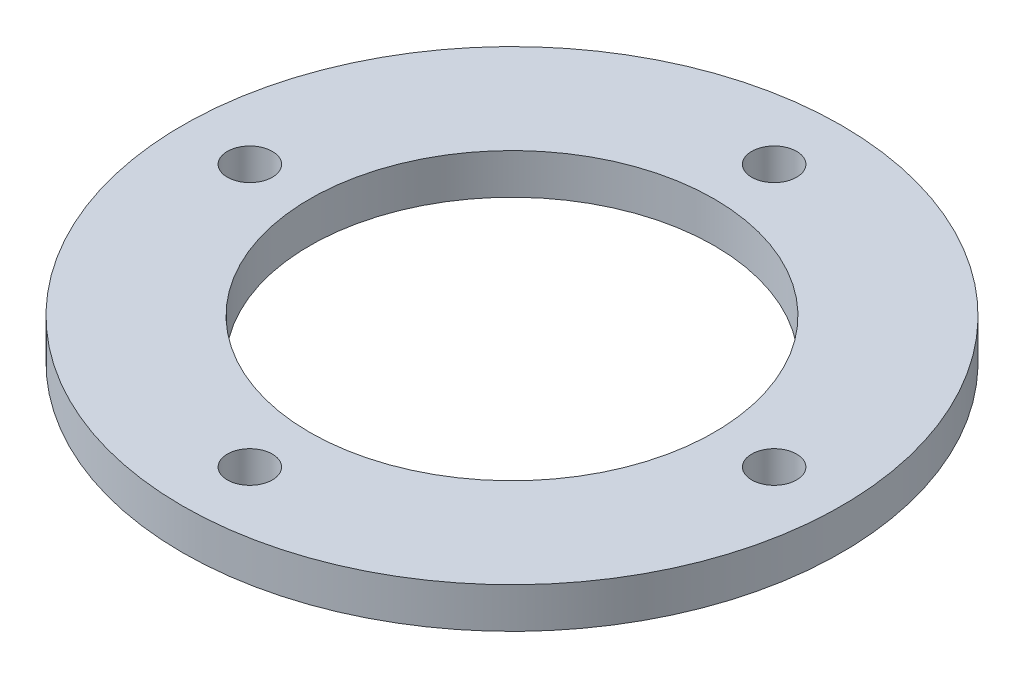
ISO-10303-21;
HEADER;
FILE_DESCRIPTION(('STEP AP214'),'2;1');
FILE_NAME('part.step','',(''),(''),'','','');
FILE_SCHEMA(('AUTOMOTIVE_DESIGN { 1 0 10303 214 1 1 1 1 }'));
ENDSEC;
DATA;
#1=APPLICATION_CONTEXT('core data for automotive mechanical design processes');
#2=APPLICATION_PROTOCOL_DEFINITION('international standard','automotive_design',2000,#1);
#3=PRODUCT_CONTEXT('',#1,'mechanical');
#4=PRODUCT('Part','Part','',(#3));
#5=PRODUCT_RELATED_PRODUCT_CATEGORY('part','',(#4));
#6=PRODUCT_DEFINITION_FORMATION('','',#4);
#7=PRODUCT_DEFINITION_CONTEXT('part definition',#1,'design');
#8=PRODUCT_DEFINITION('design','',#6,#7);
#9=PRODUCT_DEFINITION_SHAPE('','',#8);
#10=(LENGTH_UNIT() NAMED_UNIT(*) SI_UNIT(.MILLI.,.METRE.));
#11=(NAMED_UNIT(*) PLANE_ANGLE_UNIT() SI_UNIT($,.RADIAN.));
#12=(NAMED_UNIT(*) SI_UNIT($,.STERADIAN.) SOLID_ANGLE_UNIT());
#13=UNCERTAINTY_MEASURE_WITH_UNIT(LENGTH_MEASURE(1.E-05),#10,'distance_accuracy_value','');
#14=(GEOMETRIC_REPRESENTATION_CONTEXT(3) GLOBAL_UNCERTAINTY_ASSIGNED_CONTEXT((#13)) GLOBAL_UNIT_ASSIGNED_CONTEXT((#10,
#11,#12)) REPRESENTATION_CONTEXT('',''));
#15=CARTESIAN_POINT('',(0.,0.,0.));
#16=DIRECTION('',(0.,0.,1.));
#17=DIRECTION('',(1.,0.,0.));
#18=AXIS2_PLACEMENT_3D('',#15,#16,#17);
#19=CARTESIAN_POINT('',(0.,2.7,0.));
#20=DIRECTION('',(0.,1.,0.));
#21=DIRECTION('',(0.,0.,1.));
#22=AXIS2_PLACEMENT_3D('',#19,#20,#21);
#23=PLANE('',#22);
#24=CARTESIAN_POINT('',(0.,2.7,-17.5));
#25=DIRECTION('',(0.,1.,0.));
#26=DIRECTION('',(0.,0.,-1.));
#27=AXIS2_PLACEMENT_3D('',#24,#25,#26);
#28=CIRCLE('',#27,1.5);
#29=CARTESIAN_POINT('',(0.,2.7,-19.));
#30=VERTEX_POINT('',#29);
#31=EDGE_CURVE('E60',#30,#30,#28,.T.);
#32=ORIENTED_EDGE('',*,*,#31,.F.);
#33=EDGE_LOOP('',(#32));
#34=FACE_BOUND('',#33,.T.);
#35=CARTESIAN_POINT('',(0.,2.7,17.5));
#36=DIRECTION('',(0.,1.,0.));
#37=DIRECTION('',(0.,0.,-1.));
#38=AXIS2_PLACEMENT_3D('',#35,#36,#37);
#39=CIRCLE('',#38,1.5);
#40=CARTESIAN_POINT('',(0.,2.7,16.));
#41=VERTEX_POINT('',#40);
#42=EDGE_CURVE('E48',#41,#41,#39,.T.);
#43=ORIENTED_EDGE('',*,*,#42,.F.);
#44=EDGE_LOOP('',(#43));
#45=FACE_BOUND('',#44,.T.);
#46=CARTESIAN_POINT('',(0.,2.7,0.));
#47=DIRECTION('',(0.,1.,0.));
#48=DIRECTION('',(0.,0.,1.));
#49=AXIS2_PLACEMENT_3D('',#46,#47,#48);
#50=CIRCLE('',#49,22.);
#51=CARTESIAN_POINT('',(0.,2.7,22.));
#52=VERTEX_POINT('',#51);
#53=EDGE_CURVE('E10',#52,#52,#50,.T.);
#54=ORIENTED_EDGE('',*,*,#53,.T.);
#55=EDGE_LOOP('',(#54));
#56=FACE_BOUND('',#55,.T.);
#57=CARTESIAN_POINT('',(17.5,2.7,0.));
#58=DIRECTION('',(0.,1.,0.));
#59=DIRECTION('',(0.,0.,-1.));
#60=AXIS2_PLACEMENT_3D('',#57,#58,#59);
#61=CIRCLE('',#60,1.5);
#62=CARTESIAN_POINT('',(17.5,2.7,-1.50000000000001));
#63=VERTEX_POINT('',#62);
#64=EDGE_CURVE('E43',#63,#63,#61,.T.);
#65=ORIENTED_EDGE('',*,*,#64,.F.);
#66=EDGE_LOOP('',(#65));
#67=FACE_BOUND('',#66,.T.);
#68=CARTESIAN_POINT('',(-17.5,2.7,0.));
#69=DIRECTION('',(0.,1.,0.));
#70=DIRECTION('',(0.,0.,-1.));
#71=AXIS2_PLACEMENT_3D('',#68,#69,#70);
#72=CIRCLE('',#71,1.5);
#73=CARTESIAN_POINT('',(-17.5,2.7,-1.49999999999999));
#74=VERTEX_POINT('',#73);
#75=EDGE_CURVE('E54',#74,#74,#72,.T.);
#76=ORIENTED_EDGE('',*,*,#75,.F.);
#77=EDGE_LOOP('',(#76));
#78=FACE_BOUND('',#77,.T.);
#79=CARTESIAN_POINT('',(0.,2.7,0.));
#80=DIRECTION('',(0.,1.,0.));
#81=DIRECTION('',(0.,0.,-1.));
#82=AXIS2_PLACEMENT_3D('',#79,#80,#81);
#83=CIRCLE('',#82,13.5);
#84=CARTESIAN_POINT('',(0.,2.7,-13.5));
#85=VERTEX_POINT('',#84);
#86=EDGE_CURVE('E66',#85,#85,#83,.T.);
#87=ORIENTED_EDGE('',*,*,#86,.F.);
#88=EDGE_LOOP('',(#87));
#89=FACE_BOUND('',#88,.T.);
#90=ADVANCED_FACE('F32',(#34,#45,#56,#67,#78,#89),#23,.T.);
#91=CARTESIAN_POINT('',(0.,0.,0.));
#92=DIRECTION('',(0.,1.,0.));
#93=DIRECTION('',(0.,0.,1.));
#94=AXIS2_PLACEMENT_3D('',#91,#92,#93);
#95=PLANE('',#94);
#96=CARTESIAN_POINT('',(0.,0.,0.));
#97=DIRECTION('',(0.,1.,0.));
#98=DIRECTION('',(0.,0.,1.));
#99=AXIS2_PLACEMENT_3D('',#96,#97,#98);
#100=CIRCLE('',#99,22.);
#101=CARTESIAN_POINT('',(0.,0.,22.));
#102=VERTEX_POINT('',#101);
#103=EDGE_CURVE('E36',#102,#102,#100,.T.);
#104=ORIENTED_EDGE('',*,*,#103,.F.);
#105=EDGE_LOOP('',(#104));
#106=FACE_BOUND('',#105,.T.);
#107=CARTESIAN_POINT('',(17.5,0.,0.));
#108=DIRECTION('',(0.,1.,0.));
#109=DIRECTION('',(0.,0.,-1.));
#110=AXIS2_PLACEMENT_3D('',#107,#108,#109);
#111=CIRCLE('',#110,1.5);
#112=CARTESIAN_POINT('',(17.5,0.,-1.50000000000001));
#113=VERTEX_POINT('',#112);
#114=EDGE_CURVE('E45',#113,#113,#111,.T.);
#115=ORIENTED_EDGE('',*,*,#114,.T.);
#116=EDGE_LOOP('',(#115));
#117=FACE_BOUND('',#116,.T.);
#118=CARTESIAN_POINT('',(0.,0.,17.5));
#119=DIRECTION('',(0.,1.,0.));
#120=DIRECTION('',(0.,0.,-1.));
#121=AXIS2_PLACEMENT_3D('',#118,#119,#120);
#122=CIRCLE('',#121,1.5);
#123=CARTESIAN_POINT('',(0.,0.,16.));
#124=VERTEX_POINT('',#123);
#125=EDGE_CURVE('E51',#124,#124,#122,.T.);
#126=ORIENTED_EDGE('',*,*,#125,.T.);
#127=EDGE_LOOP('',(#126));
#128=FACE_BOUND('',#127,.T.);
#129=CARTESIAN_POINT('',(-17.5,0.,0.));
#130=DIRECTION('',(0.,1.,0.));
#131=DIRECTION('',(0.,0.,-1.));
#132=AXIS2_PLACEMENT_3D('',#129,#130,#131);
#133=CIRCLE('',#132,1.5);
#134=CARTESIAN_POINT('',(-17.5,0.,-1.49999999999999));
#135=VERTEX_POINT('',#134);
#136=EDGE_CURVE('E57',#135,#135,#133,.T.);
#137=ORIENTED_EDGE('',*,*,#136,.T.);
#138=EDGE_LOOP('',(#137));
#139=FACE_BOUND('',#138,.T.);
#140=CARTESIAN_POINT('',(0.,0.,-17.5));
#141=DIRECTION('',(0.,1.,0.));
#142=DIRECTION('',(0.,0.,-1.));
#143=AXIS2_PLACEMENT_3D('',#140,#141,#142);
#144=CIRCLE('',#143,1.5);
#145=CARTESIAN_POINT('',(0.,0.,-19.));
#146=VERTEX_POINT('',#145);
#147=EDGE_CURVE('E63',#146,#146,#144,.T.);
#148=ORIENTED_EDGE('',*,*,#147,.T.);
#149=EDGE_LOOP('',(#148));
#150=FACE_BOUND('',#149,.T.);
#151=CARTESIAN_POINT('',(0.,0.,0.));
#152=DIRECTION('',(0.,1.,0.));
#153=DIRECTION('',(0.,0.,-1.));
#154=AXIS2_PLACEMENT_3D('',#151,#152,#153);
#155=CIRCLE('',#154,13.5);
#156=CARTESIAN_POINT('',(0.,0.,-13.5));
#157=VERTEX_POINT('',#156);
#158=EDGE_CURVE('E69',#157,#157,#155,.T.);
#159=ORIENTED_EDGE('',*,*,#158,.T.);
#160=EDGE_LOOP('',(#159));
#161=FACE_BOUND('',#160,.T.);
#162=ADVANCED_FACE('F79',(#106,#117,#128,#139,#150,#161),#95,.F.);
#163=CARTESIAN_POINT('',(0.,2.7,0.));
#164=DIRECTION('',(0.,-1.,0.));
#165=DIRECTION('',(0.,0.,-1.));
#166=AXIS2_PLACEMENT_3D('',#163,#164,#165);
#167=CYLINDRICAL_SURFACE('',#166,22.);
#168=ORIENTED_EDGE('',*,*,#53,.F.);
#169=EDGE_LOOP('',(#168));
#170=FACE_BOUND('',#169,.T.);
#171=ORIENTED_EDGE('',*,*,#103,.T.);
#172=EDGE_LOOP('',(#171));
#173=FACE_BOUND('',#172,.T.);
#174=ADVANCED_FACE('F34',(#170,#173),#167,.T.);
#175=CARTESIAN_POINT('',(17.5,2.7,0.));
#176=DIRECTION('',(0.,-1.,0.));
#177=DIRECTION('',(0.,0.,-1.));
#178=AXIS2_PLACEMENT_3D('',#175,#176,#177);
#179=CYLINDRICAL_SURFACE('',#178,1.5);
#180=ORIENTED_EDGE('',*,*,#64,.T.);
#181=EDGE_LOOP('',(#180));
#182=FACE_BOUND('',#181,.T.);
#183=ORIENTED_EDGE('',*,*,#114,.F.);
#184=EDGE_LOOP('',(#183));
#185=FACE_BOUND('',#184,.T.);
#186=ADVANCED_FACE('F89',(#182,#185),#179,.F.);
#187=CARTESIAN_POINT('',(0.,2.7,17.5));
#188=DIRECTION('',(0.,-1.,0.));
#189=DIRECTION('',(0.,0.,-1.));
#190=AXIS2_PLACEMENT_3D('',#187,#188,#189);
#191=CYLINDRICAL_SURFACE('',#190,1.5);
#192=ORIENTED_EDGE('',*,*,#42,.T.);
#193=EDGE_LOOP('',(#192));
#194=FACE_BOUND('',#193,.T.);
#195=ORIENTED_EDGE('',*,*,#125,.F.);
#196=EDGE_LOOP('',(#195));
#197=FACE_BOUND('',#196,.T.);
#198=ADVANCED_FACE('F92',(#194,#197),#191,.F.);
#199=CARTESIAN_POINT('',(-17.5,2.7,0.));
#200=DIRECTION('',(0.,-1.,0.));
#201=DIRECTION('',(0.,0.,-1.));
#202=AXIS2_PLACEMENT_3D('',#199,#200,#201);
#203=CYLINDRICAL_SURFACE('',#202,1.5);
#204=ORIENTED_EDGE('',*,*,#75,.T.);
#205=EDGE_LOOP('',(#204));
#206=FACE_BOUND('',#205,.T.);
#207=ORIENTED_EDGE('',*,*,#136,.F.);
#208=EDGE_LOOP('',(#207));
#209=FACE_BOUND('',#208,.T.);
#210=ADVANCED_FACE('F96',(#206,#209),#203,.F.);
#211=CARTESIAN_POINT('',(0.,2.7,-17.5));
#212=DIRECTION('',(0.,-1.,0.));
#213=DIRECTION('',(0.,0.,-1.));
#214=AXIS2_PLACEMENT_3D('',#211,#212,#213);
#215=CYLINDRICAL_SURFACE('',#214,1.5);
#216=ORIENTED_EDGE('',*,*,#31,.T.);
#217=EDGE_LOOP('',(#216));
#218=FACE_BOUND('',#217,.T.);
#219=ORIENTED_EDGE('',*,*,#147,.F.);
#220=EDGE_LOOP('',(#219));
#221=FACE_BOUND('',#220,.T.);
#222=ADVANCED_FACE('F100',(#218,#221),#215,.F.);
#223=CARTESIAN_POINT('',(0.,2.7,0.));
#224=DIRECTION('',(0.,-1.,0.));
#225=DIRECTION('',(0.,0.,-1.));
#226=AXIS2_PLACEMENT_3D('',#223,#224,#225);
#227=CYLINDRICAL_SURFACE('',#226,13.5);
#228=ORIENTED_EDGE('',*,*,#86,.T.);
#229=EDGE_LOOP('',(#228));
#230=FACE_BOUND('',#229,.T.);
#231=ORIENTED_EDGE('',*,*,#158,.F.);
#232=EDGE_LOOP('',(#231));
#233=FACE_BOUND('',#232,.T.);
#234=ADVANCED_FACE('F75',(#230,#233),#227,.F.);
#235=CLOSED_SHELL('',(#90,#162,#174,#186,#198,#210,#222,#234));
#236=MANIFOLD_SOLID_BREP('B2',#235);
#237=ADVANCED_BREP_SHAPE_REPRESENTATION('',(#18,#236),#14);
#238=SHAPE_DEFINITION_REPRESENTATION(#9,#237);
ENDSEC;
END-ISO-10303-21;
